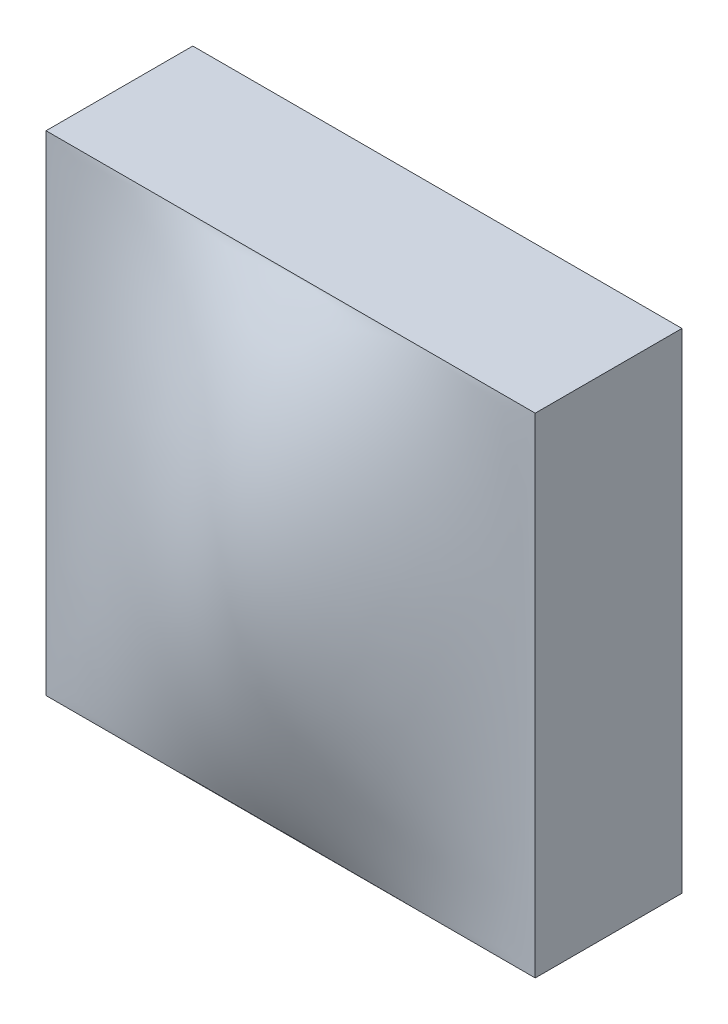
ISO-10303-21;
HEADER;
FILE_DESCRIPTION(('STEP AP214'),'2;1');
FILE_NAME('part.step','',(''),(''),'','','');
FILE_SCHEMA(('AUTOMOTIVE_DESIGN { 1 0 10303 214 1 1 1 1 }'));
ENDSEC;
DATA;
#1=APPLICATION_CONTEXT('core data for automotive mechanical design processes');
#2=APPLICATION_PROTOCOL_DEFINITION('international standard','automotive_design',2000,#1);
#3=PRODUCT_CONTEXT('',#1,'mechanical');
#4=PRODUCT('Part','Part','',(#3));
#5=PRODUCT_RELATED_PRODUCT_CATEGORY('part','',(#4));
#6=PRODUCT_DEFINITION_FORMATION('','',#4);
#7=PRODUCT_DEFINITION_CONTEXT('part definition',#1,'design');
#8=PRODUCT_DEFINITION('design','',#6,#7);
#9=PRODUCT_DEFINITION_SHAPE('','',#8);
#10=(LENGTH_UNIT() NAMED_UNIT(*) SI_UNIT(.MILLI.,.METRE.));
#11=(NAMED_UNIT(*) PLANE_ANGLE_UNIT() SI_UNIT($,.RADIAN.));
#12=(NAMED_UNIT(*) SI_UNIT($,.STERADIAN.) SOLID_ANGLE_UNIT());
#13=UNCERTAINTY_MEASURE_WITH_UNIT(LENGTH_MEASURE(1.E-05),#10,'distance_accuracy_value','');
#14=(GEOMETRIC_REPRESENTATION_CONTEXT(3) GLOBAL_UNCERTAINTY_ASSIGNED_CONTEXT((#13)) GLOBAL_UNIT_ASSIGNED_CONTEXT((#10,
#11,#12)) REPRESENTATION_CONTEXT('',''));
#15=CARTESIAN_POINT('',(0.,0.,0.));
#16=DIRECTION('',(0.,0.,1.));
#17=DIRECTION('',(1.,0.,0.));
#18=AXIS2_PLACEMENT_3D('',#15,#16,#17);
#19=CARTESIAN_POINT('',(50.,50.,30.));
#20=DIRECTION('',(-1.,0.,0.));
#21=DIRECTION('',(0.,-1.,0.));
#22=AXIS2_PLACEMENT_3D('',#19,#20,#21);
#23=PLANE('',#22);
#24=DIRECTION('',(0.,1.,0.));
#25=VECTOR('',#24,1.);
#26=CARTESIAN_POINT('',(50.,50.,0.));
#27=LINE('',#26,#25);
#28=CARTESIAN_POINT('',(50.,-50.,0.));
#29=VERTEX_POINT('',#28);
#30=CARTESIAN_POINT('',(50.,50.,0.));
#31=VERTEX_POINT('',#30);
#32=EDGE_CURVE('E134',#29,#31,#27,.T.);
#33=ORIENTED_EDGE('',*,*,#32,.T.);
#34=DIRECTION('',(0.,0.,-1.));
#35=VECTOR('',#34,1.);
#36=CARTESIAN_POINT('',(50.,50.,30.));
#37=LINE('',#36,#35);
#38=CARTESIAN_POINT('',(50.,50.,30.));
#39=VERTEX_POINT('',#38);
#40=EDGE_CURVE('E13',#39,#31,#37,.T.);
#41=ORIENTED_EDGE('',*,*,#40,.F.);
#42=DIRECTION('',(0.,1.,0.));
#43=VECTOR('',#42,1.);
#44=CARTESIAN_POINT('',(50.,50.,30.));
#45=LINE('',#44,#43);
#46=CARTESIAN_POINT('',(50.,-50.,30.));
#47=VERTEX_POINT('',#46);
#48=EDGE_CURVE('E145',#47,#39,#45,.T.);
#49=ORIENTED_EDGE('',*,*,#48,.F.);
#50=DIRECTION('',(0.,0.,-1.));
#51=VECTOR('',#50,1.);
#52=CARTESIAN_POINT('',(50.,-50.,30.));
#53=LINE('',#52,#51);
#54=EDGE_CURVE('E140',#47,#29,#53,.T.);
#55=ORIENTED_EDGE('',*,*,#54,.T.);
#56=EDGE_LOOP('',(#33,#41,#49,#55));
#57=FACE_BOUND('',#56,.T.);
#58=ADVANCED_FACE('F73',(#57),#23,.F.);
#59=CARTESIAN_POINT('',(-50.,50.,30.));
#60=DIRECTION('',(0.,-1.,0.));
#61=DIRECTION('',(0.,0.,-1.));
#62=AXIS2_PLACEMENT_3D('',#59,#60,#61);
#63=PLANE('',#62);
#64=DIRECTION('',(-1.,0.,0.));
#65=VECTOR('',#64,1.);
#66=CARTESIAN_POINT('',(-50.,50.,0.));
#67=LINE('',#66,#65);
#68=CARTESIAN_POINT('',(-50.,50.,0.));
#69=VERTEX_POINT('',#68);
#70=EDGE_CURVE('E131',#31,#69,#67,.T.);
#71=ORIENTED_EDGE('',*,*,#70,.T.);
#72=DIRECTION('',(0.,0.,-1.));
#73=VECTOR('',#72,1.);
#74=CARTESIAN_POINT('',(-50.,50.,30.));
#75=LINE('',#74,#73);
#76=CARTESIAN_POINT('',(-50.,50.,30.));
#77=VERTEX_POINT('',#76);
#78=EDGE_CURVE('E86',#77,#69,#75,.T.);
#79=ORIENTED_EDGE('',*,*,#78,.F.);
#80=DIRECTION('',(-1.,0.,0.));
#81=VECTOR('',#80,1.);
#82=CARTESIAN_POINT('',(-50.,50.,30.));
#83=LINE('',#82,#81);
#84=EDGE_CURVE('E105',#39,#77,#83,.T.);
#85=ORIENTED_EDGE('',*,*,#84,.F.);
#86=ORIENTED_EDGE('',*,*,#40,.T.);
#87=EDGE_LOOP('',(#71,#79,#85,#86));
#88=FACE_BOUND('',#87,.T.);
#89=ADVANCED_FACE('F137',(#88),#63,.F.);
#90=CARTESIAN_POINT('',(-50.,50.,30.));
#91=DIRECTION('',(1.,0.,0.));
#92=DIRECTION('',(0.,1.,0.));
#93=AXIS2_PLACEMENT_3D('',#90,#91,#92);
#94=PLANE('',#93);
#95=DIRECTION('',(0.,-1.,0.));
#96=VECTOR('',#95,1.);
#97=CARTESIAN_POINT('',(-50.,50.,0.));
#98=LINE('',#97,#96);
#99=CARTESIAN_POINT('',(-50.,-50.,0.));
#100=VERTEX_POINT('',#99);
#101=EDGE_CURVE('E123',#69,#100,#98,.T.);
#102=ORIENTED_EDGE('',*,*,#101,.T.);
#103=DIRECTION('',(0.,0.,-1.));
#104=VECTOR('',#103,1.);
#105=CARTESIAN_POINT('',(-50.,-50.,30.));
#106=LINE('',#105,#104);
#107=CARTESIAN_POINT('',(-50.,-50.,30.));
#108=VERTEX_POINT('',#107);
#109=EDGE_CURVE('E185',#108,#100,#106,.T.);
#110=ORIENTED_EDGE('',*,*,#109,.F.);
#111=DIRECTION('',(0.,-1.,0.));
#112=VECTOR('',#111,1.);
#113=CARTESIAN_POINT('',(-50.,50.,30.));
#114=LINE('',#113,#112);
#115=EDGE_CURVE('E189',#77,#108,#114,.T.);
#116=ORIENTED_EDGE('',*,*,#115,.F.);
#117=ORIENTED_EDGE('',*,*,#78,.T.);
#118=EDGE_LOOP('',(#102,#110,#116,#117));
#119=FACE_BOUND('',#118,.T.);
#120=ADVANCED_FACE('F171',(#119),#94,.F.);
#121=CARTESIAN_POINT('',(-50.,-50.,30.));
#122=DIRECTION('',(0.,1.,0.));
#123=DIRECTION('',(0.,0.,1.));
#124=AXIS2_PLACEMENT_3D('',#121,#122,#123);
#125=PLANE('',#124);
#126=DIRECTION('',(1.,0.,0.));
#127=VECTOR('',#126,1.);
#128=CARTESIAN_POINT('',(-50.,-50.,0.));
#129=LINE('',#128,#127);
#130=EDGE_CURVE('E115',#100,#29,#129,.T.);
#131=ORIENTED_EDGE('',*,*,#130,.T.);
#132=ORIENTED_EDGE('',*,*,#54,.F.);
#133=DIRECTION('',(1.,0.,0.));
#134=VECTOR('',#133,1.);
#135=CARTESIAN_POINT('',(-50.,-50.,30.));
#136=LINE('',#135,#134);
#137=EDGE_CURVE('E95',#108,#47,#136,.T.);
#138=ORIENTED_EDGE('',*,*,#137,.F.);
#139=ORIENTED_EDGE('',*,*,#109,.T.);
#140=EDGE_LOOP('',(#131,#132,#138,#139));
#141=FACE_BOUND('',#140,.T.);
#142=ADVANCED_FACE('F228',(#141),#125,.F.);
#143=CARTESIAN_POINT('',(-50.,-50.,30.));
#144=CARTESIAN_POINT('',(-50.,-33.3502520884849,30.));
#145=CARTESIAN_POINT('',(-50.,-0.0169187551515952,30.));
#146=CARTESIAN_POINT('',(-50.,33.3164145781817,30.));
#147=CARTESIAN_POINT('',(-50.,50.,30.));
#148=CARTESIAN_POINT('',(-33.3333333333333,-50.,30.));
#149=CARTESIAN_POINT('',(-33.3333333333333,-33.3502520884849,30.));
#150=CARTESIAN_POINT('',(-33.3333333333333,-0.0169187551515952,30.));
#151=CARTESIAN_POINT('',(-33.3333333333333,33.3164145781817,30.));
#152=CARTESIAN_POINT('',(-33.3333333333333,50.,30.));
#153=CARTESIAN_POINT('',(0.,-50.,30.));
#154=CARTESIAN_POINT('',(0.,-33.3502520884849,49.9797180825059));
#155=CARTESIAN_POINT('',(0.,-0.0169187551515977,70.0000412192182));
#156=CARTESIAN_POINT('',(0.,33.3164145781817,50.0203231367123));
#157=CARTESIAN_POINT('',(0.,50.,30.));
#158=CARTESIAN_POINT('',(33.3333333333333,-50.,30.));
#159=CARTESIAN_POINT('',(33.3333333333333,-33.3502520884849,30.));
#160=CARTESIAN_POINT('',(33.3333333333333,-0.0169187551515952,30.));
#161=CARTESIAN_POINT('',(33.3333333333333,33.3164145781817,30.));
#162=CARTESIAN_POINT('',(33.3333333333333,50.,30.));
#163=CARTESIAN_POINT('',(50.,-50.,30.));
#164=CARTESIAN_POINT('',(50.,-33.3502520884849,30.));
#165=CARTESIAN_POINT('',(50.,-0.0169187551515952,30.));
#166=CARTESIAN_POINT('',(50.,33.3164145781817,30.));
#167=CARTESIAN_POINT('',(50.,50.,30.));
#168=B_SPLINE_SURFACE_WITH_KNOTS('',3,3,((#143,#144,#145,#146,#147),(#148,#149,#150,#151,#152),
(#153,#154,#155,#156,#157),(#158,#159,#160,#161,#162),(#163,#164,#165,#166,#167)),.UNSPECIFIED.,
.F.,.F.,.F.,(4,1,4),(4,1,4),(0.,0.5,1.),(0.,0.499492437345452,1.),.UNSPECIFIED.);
#169=ORIENTED_EDGE('',*,*,#48,.T.);
#170=ORIENTED_EDGE('',*,*,#84,.T.);
#171=ORIENTED_EDGE('',*,*,#115,.T.);
#172=ORIENTED_EDGE('',*,*,#137,.T.);
#173=EDGE_LOOP('',(#169,#170,#171,#172));
#174=FACE_BOUND('',#173,.T.);
#175=ADVANCED_FACE('F75',(#174),#168,.T.);
#176=CARTESIAN_POINT('',(0.,0.,0.));
#177=DIRECTION('',(0.,0.,1.));
#178=DIRECTION('',(1.,0.,0.));
#179=AXIS2_PLACEMENT_3D('',#176,#177,#178);
#180=PLANE('',#179);
#181=ORIENTED_EDGE('',*,*,#32,.F.);
#182=ORIENTED_EDGE('',*,*,#130,.F.);
#183=ORIENTED_EDGE('',*,*,#101,.F.);
#184=ORIENTED_EDGE('',*,*,#70,.F.);
#185=EDGE_LOOP('',(#181,#182,#183,#184));
#186=FACE_BOUND('',#185,.T.);
#187=ADVANCED_FACE('F132',(#186),#180,.F.);
#188=CLOSED_SHELL('',(#58,#89,#120,#142,#175,#187));
#189=MANIFOLD_SOLID_BREP('B2',#188);
#190=ADVANCED_BREP_SHAPE_REPRESENTATION('',(#18,#189),#14);
#191=SHAPE_DEFINITION_REPRESENTATION(#9,#190);
ENDSEC;
END-ISO-10303-21;
